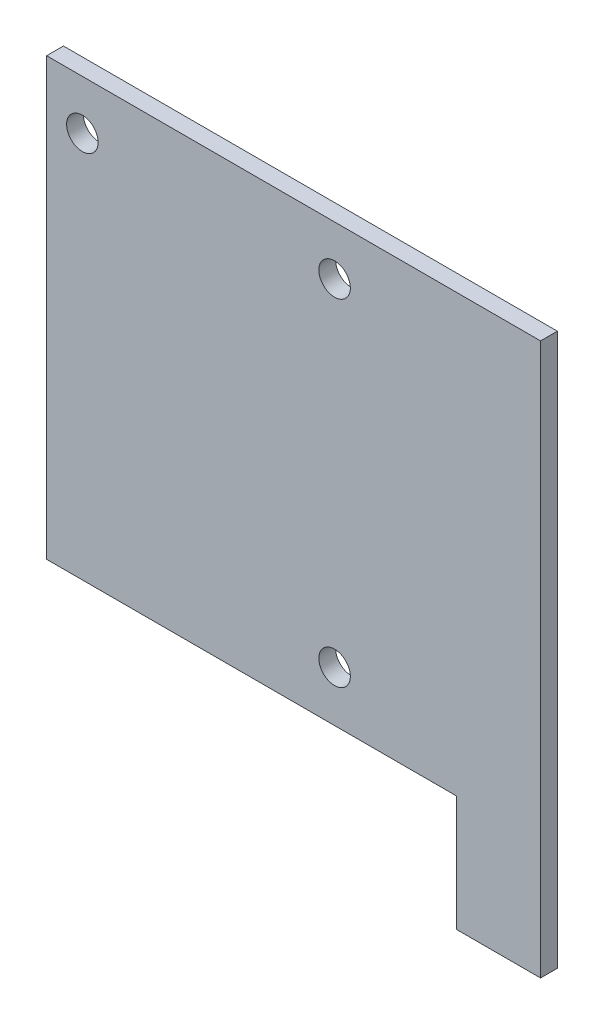
ISO-10303-21;
HEADER;
FILE_DESCRIPTION(('STEP AP214'),'2;1');
FILE_NAME('part.step','',(''),(''),'','','');
FILE_SCHEMA(('AUTOMOTIVE_DESIGN { 1 0 10303 214 1 1 1 1 }'));
ENDSEC;
DATA;
#1=APPLICATION_CONTEXT('core data for automotive mechanical design processes');
#2=APPLICATION_PROTOCOL_DEFINITION('international standard','automotive_design',2000,#1);
#3=PRODUCT_CONTEXT('',#1,'mechanical');
#4=PRODUCT('Part','Part','',(#3));
#5=PRODUCT_RELATED_PRODUCT_CATEGORY('part','',(#4));
#6=PRODUCT_DEFINITION_FORMATION('','',#4);
#7=PRODUCT_DEFINITION_CONTEXT('part definition',#1,'design');
#8=PRODUCT_DEFINITION('design','',#6,#7);
#9=PRODUCT_DEFINITION_SHAPE('','',#8);
#10=(LENGTH_UNIT() NAMED_UNIT(*) SI_UNIT(.MILLI.,.METRE.));
#11=(NAMED_UNIT(*) PLANE_ANGLE_UNIT() SI_UNIT($,.RADIAN.));
#12=(NAMED_UNIT(*) SI_UNIT($,.STERADIAN.) SOLID_ANGLE_UNIT());
#13=UNCERTAINTY_MEASURE_WITH_UNIT(LENGTH_MEASURE(1.E-05),#10,'distance_accuracy_value','');
#14=(GEOMETRIC_REPRESENTATION_CONTEXT(3) GLOBAL_UNCERTAINTY_ASSIGNED_CONTEXT((#13)) GLOBAL_UNIT_ASSIGNED_CONTEXT((#10,
#11,#12)) REPRESENTATION_CONTEXT('',''));
#15=CARTESIAN_POINT('',(0.,0.,0.));
#16=DIRECTION('',(0.,0.,1.));
#17=DIRECTION('',(1.,0.,0.));
#18=AXIS2_PLACEMENT_3D('',#15,#16,#17);
#19=CARTESIAN_POINT('',(0.,0.,1.6));
#20=DIRECTION('',(0.,0.,-1.));
#21=DIRECTION('',(-1.,0.,0.));
#22=AXIS2_PLACEMENT_3D('',#19,#20,#21);
#23=PLANE('',#22);
#24=DIRECTION('',(0.,-1.,0.));
#25=VECTOR('',#24,1.);
#26=CARTESIAN_POINT('',(-23.5,26.25,1.6));
#27=LINE('',#26,#25);
#28=CARTESIAN_POINT('',(-23.5,26.25,1.6));
#29=VERTEX_POINT('',#28);
#30=CARTESIAN_POINT('',(-23.5,-15.25,1.6));
#31=VERTEX_POINT('',#30);
#32=EDGE_CURVE('E133',#29,#31,#27,.T.);
#33=ORIENTED_EDGE('',*,*,#32,.T.);
#34=DIRECTION('',(1.,0.,0.));
#35=VECTOR('',#34,1.);
#36=CARTESIAN_POINT('',(15.5,-15.25,1.6));
#37=LINE('',#36,#35);
#38=CARTESIAN_POINT('',(15.5,-15.25,1.6));
#39=VERTEX_POINT('',#38);
#40=EDGE_CURVE('E91',#31,#39,#37,.T.);
#41=ORIENTED_EDGE('',*,*,#40,.T.);
#42=DIRECTION('',(0.,-1.,0.));
#43=VECTOR('',#42,1.);
#44=CARTESIAN_POINT('',(15.5,-26.25,1.6));
#45=LINE('',#44,#43);
#46=CARTESIAN_POINT('',(15.5,-26.25,1.6));
#47=VERTEX_POINT('',#46);
#48=EDGE_CURVE('E104',#39,#47,#45,.T.);
#49=ORIENTED_EDGE('',*,*,#48,.T.);
#50=DIRECTION('',(1.,0.,0.));
#51=VECTOR('',#50,1.);
#52=CARTESIAN_POINT('',(15.5,-26.25,1.6));
#53=LINE('',#52,#51);
#54=CARTESIAN_POINT('',(23.5,-26.25,1.6));
#55=VERTEX_POINT('',#54);
#56=EDGE_CURVE('E98',#47,#55,#53,.T.);
#57=ORIENTED_EDGE('',*,*,#56,.T.);
#58=DIRECTION('',(0.,1.,0.));
#59=VECTOR('',#58,1.);
#60=CARTESIAN_POINT('',(23.5,26.25,1.6));
#61=LINE('',#60,#59);
#62=CARTESIAN_POINT('',(23.5,26.25,1.6));
#63=VERTEX_POINT('',#62);
#64=EDGE_CURVE('E102',#55,#63,#61,.T.);
#65=ORIENTED_EDGE('',*,*,#64,.T.);
#66=DIRECTION('',(-1.,0.,0.));
#67=VECTOR('',#66,1.);
#68=CARTESIAN_POINT('',(-23.5,26.25,1.6));
#69=LINE('',#68,#67);
#70=EDGE_CURVE('E54',#63,#29,#69,.T.);
#71=ORIENTED_EDGE('',*,*,#70,.T.);
#72=EDGE_LOOP('',(#33,#41,#49,#57,#65,#71));
#73=FACE_BOUND('',#72,.T.);
#74=CARTESIAN_POINT('',(3.9,21.55,1.6));
#75=DIRECTION('',(0.,0.,1.));
#76=DIRECTION('',(1.,0.,0.));
#77=AXIS2_PLACEMENT_3D('',#74,#75,#76);
#78=CIRCLE('',#77,1.5);
#79=CARTESIAN_POINT('',(5.4,21.55,1.6));
#80=VERTEX_POINT('',#79);
#81=EDGE_CURVE('E126',#80,#80,#78,.T.);
#82=ORIENTED_EDGE('',*,*,#81,.F.);
#83=EDGE_LOOP('',(#82));
#84=FACE_BOUND('',#83,.T.);
#85=CARTESIAN_POINT('',(3.9,-10.45,1.6));
#86=DIRECTION('',(0.,0.,1.));
#87=DIRECTION('',(1.,0.,0.));
#88=AXIS2_PLACEMENT_3D('',#85,#86,#87);
#89=CIRCLE('',#88,1.5);
#90=CARTESIAN_POINT('',(5.4,-10.45,1.6));
#91=VERTEX_POINT('',#90);
#92=EDGE_CURVE('E187',#91,#91,#89,.T.);
#93=ORIENTED_EDGE('',*,*,#92,.F.);
#94=EDGE_LOOP('',(#93));
#95=FACE_BOUND('',#94,.T.);
#96=CARTESIAN_POINT('',(-20.1,21.55,1.6));
#97=DIRECTION('',(0.,0.,1.));
#98=DIRECTION('',(1.,0.,0.));
#99=AXIS2_PLACEMENT_3D('',#96,#97,#98);
#100=CIRCLE('',#99,1.5);
#101=CARTESIAN_POINT('',(-18.6,21.55,1.6));
#102=VERTEX_POINT('',#101);
#103=EDGE_CURVE('E178',#102,#102,#100,.T.);
#104=ORIENTED_EDGE('',*,*,#103,.F.);
#105=EDGE_LOOP('',(#104));
#106=FACE_BOUND('',#105,.T.);
#107=ADVANCED_FACE('F37',(#73,#84,#95,#106),#23,.F.);
#108=CARTESIAN_POINT('',(0.,0.,0.));
#109=DIRECTION('',(0.,0.,-1.));
#110=DIRECTION('',(-1.,0.,0.));
#111=AXIS2_PLACEMENT_3D('',#108,#109,#110);
#112=PLANE('',#111);
#113=CARTESIAN_POINT('',(3.9,-10.45,0.));
#114=DIRECTION('',(0.,0.,1.));
#115=DIRECTION('',(1.,0.,0.));
#116=AXIS2_PLACEMENT_3D('',#113,#114,#115);
#117=CIRCLE('',#116,1.5);
#118=CARTESIAN_POINT('',(5.4,-10.45,0.));
#119=VERTEX_POINT('',#118);
#120=EDGE_CURVE('E184',#119,#119,#117,.T.);
#121=ORIENTED_EDGE('',*,*,#120,.T.);
#122=EDGE_LOOP('',(#121));
#123=FACE_BOUND('',#122,.T.);
#124=DIRECTION('',(0.,-1.,0.));
#125=VECTOR('',#124,1.);
#126=CARTESIAN_POINT('',(-23.5,26.25,0.));
#127=LINE('',#126,#125);
#128=CARTESIAN_POINT('',(-23.5,26.25,0.));
#129=VERTEX_POINT('',#128);
#130=CARTESIAN_POINT('',(-23.5,-15.25,0.));
#131=VERTEX_POINT('',#130);
#132=EDGE_CURVE('E122',#129,#131,#127,.T.);
#133=ORIENTED_EDGE('',*,*,#132,.F.);
#134=DIRECTION('',(-1.,0.,0.));
#135=VECTOR('',#134,1.);
#136=CARTESIAN_POINT('',(-23.5,26.25,0.));
#137=LINE('',#136,#135);
#138=CARTESIAN_POINT('',(23.5,26.25,0.));
#139=VERTEX_POINT('',#138);
#140=EDGE_CURVE('E83',#139,#129,#137,.T.);
#141=ORIENTED_EDGE('',*,*,#140,.F.);
#142=DIRECTION('',(0.,1.,0.));
#143=VECTOR('',#142,1.);
#144=CARTESIAN_POINT('',(23.5,26.25,0.));
#145=LINE('',#144,#143);
#146=CARTESIAN_POINT('',(23.5,-26.25,0.));
#147=VERTEX_POINT('',#146);
#148=EDGE_CURVE('E77',#147,#139,#145,.T.);
#149=ORIENTED_EDGE('',*,*,#148,.F.);
#150=DIRECTION('',(1.,0.,0.));
#151=VECTOR('',#150,1.);
#152=CARTESIAN_POINT('',(15.5,-26.25,0.));
#153=LINE('',#152,#151);
#154=CARTESIAN_POINT('',(15.5,-26.25,0.));
#155=VERTEX_POINT('',#154);
#156=EDGE_CURVE('E112',#155,#147,#153,.T.);
#157=ORIENTED_EDGE('',*,*,#156,.F.);
#158=DIRECTION('',(0.,-1.,0.));
#159=VECTOR('',#158,1.);
#160=CARTESIAN_POINT('',(15.5,-26.25,0.));
#161=LINE('',#160,#159);
#162=CARTESIAN_POINT('',(15.5,-15.25,0.));
#163=VERTEX_POINT('',#162);
#164=EDGE_CURVE('E128',#163,#155,#161,.T.);
#165=ORIENTED_EDGE('',*,*,#164,.F.);
#166=DIRECTION('',(1.,0.,0.));
#167=VECTOR('',#166,1.);
#168=CARTESIAN_POINT('',(15.5,-15.25,0.));
#169=LINE('',#168,#167);
#170=EDGE_CURVE('E125',#131,#163,#169,.T.);
#171=ORIENTED_EDGE('',*,*,#170,.F.);
#172=EDGE_LOOP('',(#133,#141,#149,#157,#165,#171));
#173=FACE_BOUND('',#172,.T.);
#174=CARTESIAN_POINT('',(3.9,21.55,0.));
#175=DIRECTION('',(0.,0.,1.));
#176=DIRECTION('',(1.,0.,0.));
#177=AXIS2_PLACEMENT_3D('',#174,#175,#176);
#178=CIRCLE('',#177,1.5);
#179=CARTESIAN_POINT('',(5.4,21.55,0.));
#180=VERTEX_POINT('',#179);
#181=EDGE_CURVE('E190',#180,#180,#178,.T.);
#182=ORIENTED_EDGE('',*,*,#181,.T.);
#183=EDGE_LOOP('',(#182));
#184=FACE_BOUND('',#183,.T.);
#185=CARTESIAN_POINT('',(-20.1,21.55,0.));
#186=DIRECTION('',(0.,0.,1.));
#187=DIRECTION('',(1.,0.,0.));
#188=AXIS2_PLACEMENT_3D('',#185,#186,#187);
#189=CIRCLE('',#188,1.5);
#190=CARTESIAN_POINT('',(-18.6,21.55,0.));
#191=VERTEX_POINT('',#190);
#192=EDGE_CURVE('E181',#191,#191,#189,.T.);
#193=ORIENTED_EDGE('',*,*,#192,.T.);
#194=EDGE_LOOP('',(#193));
#195=FACE_BOUND('',#194,.T.);
#196=ADVANCED_FACE('F142',(#123,#173,#184,#195),#112,.T.);
#197=CARTESIAN_POINT('',(-23.5,26.25,1.6));
#198=DIRECTION('',(1.,0.,0.));
#199=DIRECTION('',(0.,1.,0.));
#200=AXIS2_PLACEMENT_3D('',#197,#198,#199);
#201=PLANE('',#200);
#202=ORIENTED_EDGE('',*,*,#132,.T.);
#203=DIRECTION('',(0.,0.,-1.));
#204=VECTOR('',#203,1.);
#205=CARTESIAN_POINT('',(-23.5,-15.25,1.6));
#206=LINE('',#205,#204);
#207=EDGE_CURVE('E11',#31,#131,#206,.T.);
#208=ORIENTED_EDGE('',*,*,#207,.F.);
#209=ORIENTED_EDGE('',*,*,#32,.F.);
#210=DIRECTION('',(0.,0.,-1.));
#211=VECTOR('',#210,1.);
#212=CARTESIAN_POINT('',(-23.5,26.25,1.6));
#213=LINE('',#212,#211);
#214=EDGE_CURVE('E118',#29,#129,#213,.T.);
#215=ORIENTED_EDGE('',*,*,#214,.T.);
#216=EDGE_LOOP('',(#202,#208,#209,#215));
#217=FACE_BOUND('',#216,.T.);
#218=ADVANCED_FACE('F39',(#217),#201,.F.);
#219=CARTESIAN_POINT('',(15.5,-15.25,1.6));
#220=DIRECTION('',(0.,1.,0.));
#221=DIRECTION('',(-1.,0.,0.));
#222=AXIS2_PLACEMENT_3D('',#219,#220,#221);
#223=PLANE('',#222);
#224=ORIENTED_EDGE('',*,*,#170,.T.);
#225=DIRECTION('',(0.,0.,-1.));
#226=VECTOR('',#225,1.);
#227=CARTESIAN_POINT('',(15.5,-15.25,1.6));
#228=LINE('',#227,#226);
#229=EDGE_CURVE('E46',#39,#163,#228,.T.);
#230=ORIENTED_EDGE('',*,*,#229,.F.);
#231=ORIENTED_EDGE('',*,*,#40,.F.);
#232=ORIENTED_EDGE('',*,*,#207,.T.);
#233=EDGE_LOOP('',(#224,#230,#231,#232));
#234=FACE_BOUND('',#233,.T.);
#235=ADVANCED_FACE('F241',(#234),#223,.F.);
#236=CARTESIAN_POINT('',(15.5,-26.25,1.6));
#237=DIRECTION('',(1.,0.,0.));
#238=DIRECTION('',(0.,1.,0.));
#239=AXIS2_PLACEMENT_3D('',#236,#237,#238);
#240=PLANE('',#239);
#241=ORIENTED_EDGE('',*,*,#164,.T.);
#242=DIRECTION('',(0.,0.,-1.));
#243=VECTOR('',#242,1.);
#244=CARTESIAN_POINT('',(15.5,-26.25,1.6));
#245=LINE('',#244,#243);
#246=EDGE_CURVE('E113',#47,#155,#245,.T.);
#247=ORIENTED_EDGE('',*,*,#246,.F.);
#248=ORIENTED_EDGE('',*,*,#48,.F.);
#249=ORIENTED_EDGE('',*,*,#229,.T.);
#250=EDGE_LOOP('',(#241,#247,#248,#249));
#251=FACE_BOUND('',#250,.T.);
#252=ADVANCED_FACE('F139',(#251),#240,.F.);
#253=CARTESIAN_POINT('',(15.5,-26.25,1.6));
#254=DIRECTION('',(0.,1.,0.));
#255=DIRECTION('',(0.,0.,1.));
#256=AXIS2_PLACEMENT_3D('',#253,#254,#255);
#257=PLANE('',#256);
#258=ORIENTED_EDGE('',*,*,#156,.T.);
#259=DIRECTION('',(0.,0.,-1.));
#260=VECTOR('',#259,1.);
#261=CARTESIAN_POINT('',(23.5,-26.25,1.6));
#262=LINE('',#261,#260);
#263=EDGE_CURVE('E109',#55,#147,#262,.T.);
#264=ORIENTED_EDGE('',*,*,#263,.F.);
#265=ORIENTED_EDGE('',*,*,#56,.F.);
#266=ORIENTED_EDGE('',*,*,#246,.T.);
#267=EDGE_LOOP('',(#258,#264,#265,#266));
#268=FACE_BOUND('',#267,.T.);
#269=ADVANCED_FACE('F110',(#268),#257,.F.);
#270=CARTESIAN_POINT('',(23.5,26.25,1.6));
#271=DIRECTION('',(-1.,0.,0.));
#272=DIRECTION('',(0.,0.,1.));
#273=AXIS2_PLACEMENT_3D('',#270,#271,#272);
#274=PLANE('',#273);
#275=ORIENTED_EDGE('',*,*,#148,.T.);
#276=DIRECTION('',(0.,0.,-1.));
#277=VECTOR('',#276,1.);
#278=CARTESIAN_POINT('',(23.5,26.25,1.6));
#279=LINE('',#278,#277);
#280=EDGE_CURVE('E114',#63,#139,#279,.T.);
#281=ORIENTED_EDGE('',*,*,#280,.F.);
#282=ORIENTED_EDGE('',*,*,#64,.F.);
#283=ORIENTED_EDGE('',*,*,#263,.T.);
#284=EDGE_LOOP('',(#275,#281,#282,#283));
#285=FACE_BOUND('',#284,.T.);
#286=ADVANCED_FACE('F116',(#285),#274,.F.);
#287=CARTESIAN_POINT('',(-23.5,26.25,1.6));
#288=DIRECTION('',(0.,-1.,0.));
#289=DIRECTION('',(0.,0.,-1.));
#290=AXIS2_PLACEMENT_3D('',#287,#288,#289);
#291=PLANE('',#290);
#292=ORIENTED_EDGE('',*,*,#140,.T.);
#293=ORIENTED_EDGE('',*,*,#214,.F.);
#294=ORIENTED_EDGE('',*,*,#70,.F.);
#295=ORIENTED_EDGE('',*,*,#280,.T.);
#296=EDGE_LOOP('',(#292,#293,#294,#295));
#297=FACE_BOUND('',#296,.T.);
#298=ADVANCED_FACE('F147',(#297),#291,.F.);
#299=CARTESIAN_POINT('',(3.9,21.55,1.6));
#300=DIRECTION('',(0.,0.,-1.));
#301=DIRECTION('',(-1.,0.,0.));
#302=AXIS2_PLACEMENT_3D('',#299,#300,#301);
#303=CYLINDRICAL_SURFACE('',#302,1.5);
#304=ORIENTED_EDGE('',*,*,#81,.T.);
#305=EDGE_LOOP('',(#304));
#306=FACE_BOUND('',#305,.T.);
#307=ORIENTED_EDGE('',*,*,#181,.F.);
#308=EDGE_LOOP('',(#307));
#309=FACE_BOUND('',#308,.T.);
#310=ADVANCED_FACE('F149',(#306,#309),#303,.F.);
#311=CARTESIAN_POINT('',(3.9,-10.45,1.6));
#312=DIRECTION('',(0.,0.,-1.));
#313=DIRECTION('',(-1.,0.,0.));
#314=AXIS2_PLACEMENT_3D('',#311,#312,#313);
#315=CYLINDRICAL_SURFACE('',#314,1.5);
#316=ORIENTED_EDGE('',*,*,#92,.T.);
#317=EDGE_LOOP('',(#316));
#318=FACE_BOUND('',#317,.T.);
#319=ORIENTED_EDGE('',*,*,#120,.F.);
#320=EDGE_LOOP('',(#319));
#321=FACE_BOUND('',#320,.T.);
#322=ADVANCED_FACE('F155',(#318,#321),#315,.F.);
#323=CARTESIAN_POINT('',(-20.1,21.55,1.6));
#324=DIRECTION('',(0.,0.,-1.));
#325=DIRECTION('',(-1.,0.,0.));
#326=AXIS2_PLACEMENT_3D('',#323,#324,#325);
#327=CYLINDRICAL_SURFACE('',#326,1.5);
#328=ORIENTED_EDGE('',*,*,#103,.T.);
#329=EDGE_LOOP('',(#328));
#330=FACE_BOUND('',#329,.T.);
#331=ORIENTED_EDGE('',*,*,#192,.F.);
#332=EDGE_LOOP('',(#331));
#333=FACE_BOUND('',#332,.T.);
#334=ADVANCED_FACE('F169',(#330,#333),#327,.F.);
#335=CLOSED_SHELL('',(#107,#196,#218,#235,#252,#269,#286,#298,#310,#322,#334));
#336=MANIFOLD_SOLID_BREP('B2',#335);
#337=ADVANCED_BREP_SHAPE_REPRESENTATION('',(#18,#336),#14);
#338=SHAPE_DEFINITION_REPRESENTATION(#9,#337);
ENDSEC;
END-ISO-10303-21;
